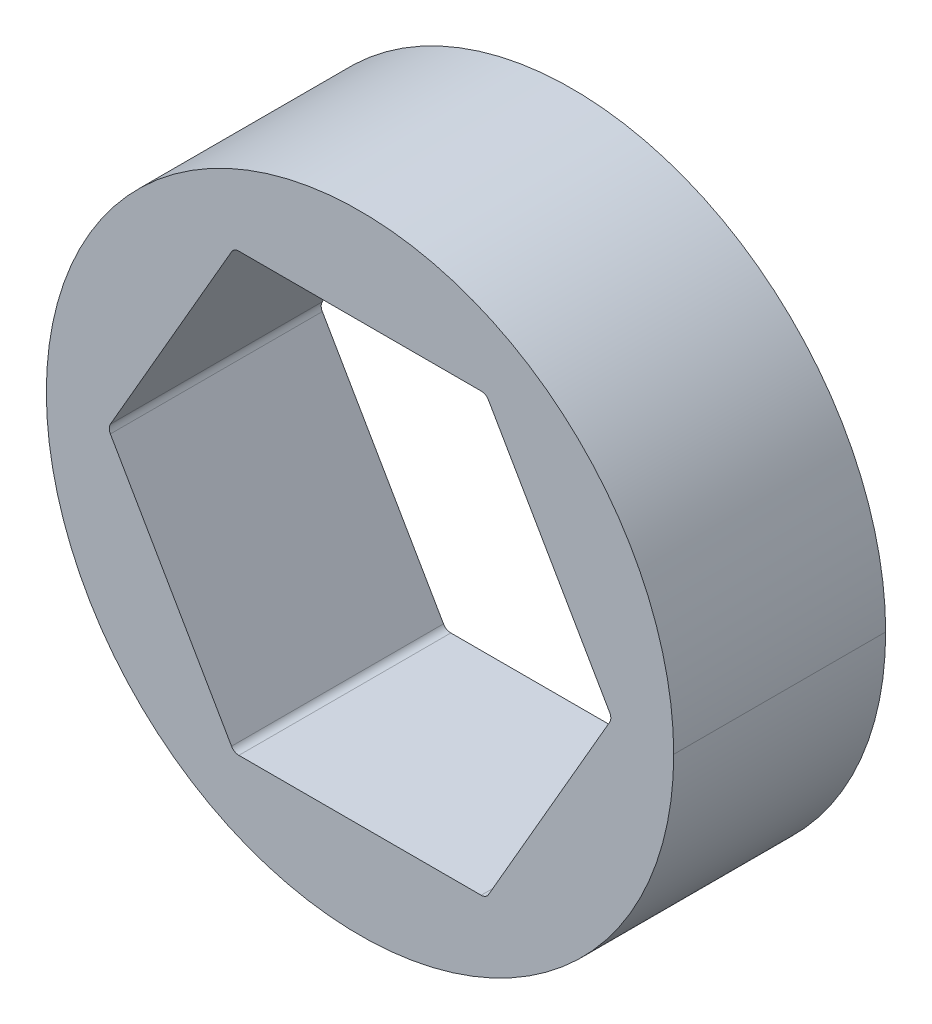
ISO-10303-21;
HEADER;
FILE_DESCRIPTION(('STEP AP214'),'2;1');
FILE_NAME('part.step','',(''),(''),'','','');
FILE_SCHEMA(('AUTOMOTIVE_DESIGN { 1 0 10303 214 1 1 1 1 }'));
ENDSEC;
DATA;
#1=APPLICATION_CONTEXT('core data for automotive mechanical design processes');
#2=APPLICATION_PROTOCOL_DEFINITION('international standard','automotive_design',2000,#1);
#3=PRODUCT_CONTEXT('',#1,'mechanical');
#4=PRODUCT('Part','Part','',(#3));
#5=PRODUCT_RELATED_PRODUCT_CATEGORY('part','',(#4));
#6=PRODUCT_DEFINITION_FORMATION('','',#4);
#7=PRODUCT_DEFINITION_CONTEXT('part definition',#1,'design');
#8=PRODUCT_DEFINITION('design','',#6,#7);
#9=PRODUCT_DEFINITION_SHAPE('','',#8);
#10=(LENGTH_UNIT() NAMED_UNIT(*) SI_UNIT(.MILLI.,.METRE.));
#11=(NAMED_UNIT(*) PLANE_ANGLE_UNIT() SI_UNIT($,.RADIAN.));
#12=(NAMED_UNIT(*) SI_UNIT($,.STERADIAN.) SOLID_ANGLE_UNIT());
#13=UNCERTAINTY_MEASURE_WITH_UNIT(LENGTH_MEASURE(1.E-05),#10,'distance_accuracy_value','');
#14=(GEOMETRIC_REPRESENTATION_CONTEXT(3) GLOBAL_UNCERTAINTY_ASSIGNED_CONTEXT((#13)) GLOBAL_UNIT_ASSIGNED_CONTEXT((#10,
#11,#12)) REPRESENTATION_CONTEXT('',''));
#15=CARTESIAN_POINT('',(0.,0.,0.));
#16=DIRECTION('',(0.,0.,1.));
#17=DIRECTION('',(1.,0.,0.));
#18=AXIS2_PLACEMENT_3D('',#15,#16,#17);
#19=CARTESIAN_POINT('',(7.25902493452117,0.,30.48));
#20=DIRECTION('',(0.,0.,1.));
#21=DIRECTION('',(1.,0.,0.));
#22=AXIS2_PLACEMENT_3D('',#19,#20,#21);
#23=CYLINDRICAL_SURFACE('',#22,0.254);
#24=CARTESIAN_POINT('',(7.25902493452117,0.,6.35));
#25=DIRECTION('',(0.,0.,1.));
#26=DIRECTION('',(1.,0.,0.));
#27=AXIS2_PLACEMENT_3D('',#24,#25,#26);
#28=CIRCLE('',#27,0.254);
#29=CARTESIAN_POINT('',(7.47899538708242,0.127,6.35));
#30=VERTEX_POINT('',#29);
#31=CARTESIAN_POINT('',(7.51302493452117,0.,6.35));
#32=VERTEX_POINT('',#31);
#33=EDGE_CURVE('E301',#30,#32,#28,.F.);
#34=ORIENTED_EDGE('',*,*,#33,.F.);
#35=DIRECTION('',(0.,0.,1.));
#36=VECTOR('',#35,1.);
#37=CARTESIAN_POINT('',(7.47899538708242,0.127,30.48));
#38=LINE('',#37,#36);
#39=CARTESIAN_POINT('',(7.47899538708242,0.127,0.));
#40=VERTEX_POINT('',#39);
#41=EDGE_CURVE('E267',#40,#30,#38,.T.);
#42=ORIENTED_EDGE('',*,*,#41,.F.);
#43=CARTESIAN_POINT('',(7.25902493452117,0.,0.));
#44=DIRECTION('',(0.,0.,1.));
#45=DIRECTION('',(1.,0.,0.));
#46=AXIS2_PLACEMENT_3D('',#43,#44,#45);
#47=CIRCLE('',#46,0.254);
#48=CARTESIAN_POINT('',(7.51302493452117,0.,0.));
#49=VERTEX_POINT('',#48);
#50=EDGE_CURVE('E199',#49,#40,#47,.T.);
#51=ORIENTED_EDGE('',*,*,#50,.F.);
#52=DIRECTION('',(0.,0.,1.));
#53=VECTOR('',#52,1.);
#54=CARTESIAN_POINT('',(7.51302493452117,0.,30.48));
#55=LINE('',#54,#53);
#56=EDGE_CURVE('E53',#49,#32,#55,.T.);
#57=ORIENTED_EDGE('',*,*,#56,.T.);
#58=EDGE_LOOP('',(#34,#42,#51,#57));
#59=FACE_BOUND('',#58,.T.);
#60=ADVANCED_FACE('F44',(#59),#23,.F.);
#61=CARTESIAN_POINT('',(0.,0.,30.48));
#62=DIRECTION('',(0.,0.,-1.));
#63=DIRECTION('',(-1.,0.,0.));
#64=AXIS2_PLACEMENT_3D('',#61,#62,#63);
#65=CYLINDRICAL_SURFACE('',#64,9.398);
#66=DIRECTION('',(0.,0.,-1.));
#67=VECTOR('',#66,1.);
#68=CARTESIAN_POINT('',(-9.398,0.,30.48));
#69=LINE('',#68,#67);
#70=CARTESIAN_POINT('',(-9.398,0.,6.35));
#71=VERTEX_POINT('',#70);
#72=CARTESIAN_POINT('',(-9.398,0.,0.));
#73=VERTEX_POINT('',#72);
#74=EDGE_CURVE('E175',#71,#73,#69,.T.);
#75=ORIENTED_EDGE('',*,*,#74,.F.);
#76=CARTESIAN_POINT('',(0.,0.,6.35));
#77=DIRECTION('',(0.,0.,1.));
#78=DIRECTION('',(1.,0.,0.));
#79=AXIS2_PLACEMENT_3D('',#76,#77,#78);
#80=CIRCLE('',#79,9.398);
#81=CARTESIAN_POINT('',(9.398,0.,6.35));
#82=VERTEX_POINT('',#81);
#83=EDGE_CURVE('E59',#82,#71,#80,.T.);
#84=ORIENTED_EDGE('',*,*,#83,.F.);
#85=DIRECTION('',(0.,0.,-1.));
#86=VECTOR('',#85,1.);
#87=CARTESIAN_POINT('',(9.398,0.,30.48));
#88=LINE('',#87,#86);
#89=CARTESIAN_POINT('',(9.398,0.,0.));
#90=VERTEX_POINT('',#89);
#91=EDGE_CURVE('E173',#82,#90,#88,.T.);
#92=ORIENTED_EDGE('',*,*,#91,.T.);
#93=CARTESIAN_POINT('',(0.,0.,0.));
#94=DIRECTION('',(0.,0.,1.));
#95=DIRECTION('',(1.,0.,0.));
#96=AXIS2_PLACEMENT_3D('',#93,#94,#95);
#97=CIRCLE('',#96,9.398);
#98=EDGE_CURVE('E182',#90,#73,#97,.T.);
#99=ORIENTED_EDGE('',*,*,#98,.T.);
#100=EDGE_LOOP('',(#75,#84,#92,#99));
#101=FACE_BOUND('',#100,.T.);
#102=ADVANCED_FACE('F171',(#101),#65,.T.);
#103=CARTESIAN_POINT('',(0.,0.,30.48));
#104=DIRECTION('',(0.,0.,-1.));
#105=DIRECTION('',(-1.,0.,0.));
#106=AXIS2_PLACEMENT_3D('',#103,#104,#105);
#107=CYLINDRICAL_SURFACE('',#106,9.398);
#108=ORIENTED_EDGE('',*,*,#91,.F.);
#109=EDGE_CURVE('E163',#71,#82,#80,.T.);
#110=ORIENTED_EDGE('',*,*,#109,.F.);
#111=ORIENTED_EDGE('',*,*,#74,.T.);
#112=CARTESIAN_POINT('',(0.,0.,0.));
#113=DIRECTION('',(0.,0.,1.));
#114=DIRECTION('',(1.,0.,0.));
#115=AXIS2_PLACEMENT_3D('',#112,#113,#114);
#116=CIRCLE('',#115,9.398);
#117=EDGE_CURVE('E180',#73,#90,#116,.T.);
#118=ORIENTED_EDGE('',*,*,#117,.T.);
#119=EDGE_LOOP('',(#108,#110,#111,#118));
#120=FACE_BOUND('',#119,.T.);
#121=ADVANCED_FACE('F178',(#120),#107,.T.);
#122=CARTESIAN_POINT('',(3.77615943563475,-6.5405,30.48));
#123=DIRECTION('',(-0.866025403784439,0.5,0.));
#124=DIRECTION('',(0.,0.,1.));
#125=AXIS2_PLACEMENT_3D('',#122,#123,#124);
#126=PLANE('',#125);
#127=DIRECTION('',(0.,0.,1.));
#128=VECTOR('',#127,1.);
#129=CARTESIAN_POINT('',(3.84948291982184,-6.4135,30.48));
#130=LINE('',#129,#128);
#131=CARTESIAN_POINT('',(3.84948291982184,-6.4135,0.));
#132=VERTEX_POINT('',#131);
#133=CARTESIAN_POINT('',(3.84948291982184,-6.4135,6.35));
#134=VERTEX_POINT('',#133);
#135=EDGE_CURVE('E218',#132,#134,#130,.T.);
#136=ORIENTED_EDGE('',*,*,#135,.T.);
#137=DIRECTION('',(0.5,0.866025403784439,0.));
#138=VECTOR('',#137,1.);
#139=CARTESIAN_POINT('',(3.77615943563475,-6.5405,6.35));
#140=LINE('',#139,#138);
#141=CARTESIAN_POINT('',(7.47899538708242,-0.127000000000001,6.35));
#142=VERTEX_POINT('',#141);
#143=EDGE_CURVE('E311',#134,#142,#140,.T.);
#144=ORIENTED_EDGE('',*,*,#143,.T.);
#145=DIRECTION('',(0.,0.,-1.));
#146=VECTOR('',#145,1.);
#147=CARTESIAN_POINT('',(7.47899538708242,-0.127,0.));
#148=LINE('',#147,#146);
#149=CARTESIAN_POINT('',(7.47899538708242,-0.127000000000001,0.));
#150=VERTEX_POINT('',#149);
#151=EDGE_CURVE('E222',#142,#150,#148,.T.);
#152=ORIENTED_EDGE('',*,*,#151,.T.);
#153=DIRECTION('',(0.5,0.866025403784439,0.));
#154=VECTOR('',#153,1.);
#155=CARTESIAN_POINT('',(3.77615943563475,-6.5405,0.));
#156=LINE('',#155,#154);
#157=EDGE_CURVE('E198',#132,#150,#156,.T.);
#158=ORIENTED_EDGE('',*,*,#157,.F.);
#159=EDGE_LOOP('',(#136,#144,#152,#158));
#160=FACE_BOUND('',#159,.T.);
#161=ADVANCED_FACE('F434',(#160),#126,.T.);
#162=CARTESIAN_POINT('',(7.5523188712695,0.,30.48));
#163=DIRECTION('',(-0.866025403784438,-0.5,0.));
#164=DIRECTION('',(-0.5,0.866025403784438,0.));
#165=AXIS2_PLACEMENT_3D('',#162,#163,#164);
#166=PLANE('',#165);
#167=ORIENTED_EDGE('',*,*,#41,.T.);
#168=DIRECTION('',(-0.5,0.866025403784438,0.));
#169=VECTOR('',#168,1.);
#170=CARTESIAN_POINT('',(7.5523188712695,0.,6.35));
#171=LINE('',#170,#169);
#172=CARTESIAN_POINT('',(3.84948291982183,6.4135,6.35));
#173=VERTEX_POINT('',#172);
#174=EDGE_CURVE('E296',#30,#173,#171,.T.);
#175=ORIENTED_EDGE('',*,*,#174,.T.);
#176=DIRECTION('',(0.,0.,-1.));
#177=VECTOR('',#176,1.);
#178=CARTESIAN_POINT('',(3.84948291982183,6.4135,0.));
#179=LINE('',#178,#177);
#180=CARTESIAN_POINT('',(3.84948291982183,6.4135,0.));
#181=VERTEX_POINT('',#180);
#182=EDGE_CURVE('E228',#173,#181,#179,.T.);
#183=ORIENTED_EDGE('',*,*,#182,.T.);
#184=DIRECTION('',(-0.5,0.866025403784438,0.));
#185=VECTOR('',#184,1.);
#186=CARTESIAN_POINT('',(7.5523188712695,0.,0.));
#187=LINE('',#186,#185);
#188=EDGE_CURVE('E226',#40,#181,#187,.T.);
#189=ORIENTED_EDGE('',*,*,#188,.F.);
#190=EDGE_LOOP('',(#167,#175,#183,#189));
#191=FACE_BOUND('',#190,.T.);
#192=ADVANCED_FACE('F295',(#191),#166,.T.);
#193=CARTESIAN_POINT('',(3.77615943563475,6.5405,30.48));
#194=DIRECTION('',(0.,-1.,0.));
#195=DIRECTION('',(0.,0.,-1.));
#196=AXIS2_PLACEMENT_3D('',#193,#194,#195);
#197=PLANE('',#196);
#198=DIRECTION('',(0.,0.,1.));
#199=VECTOR('',#198,1.);
#200=CARTESIAN_POINT('',(3.62951246726058,6.5405,30.48));
#201=LINE('',#200,#199);
#202=CARTESIAN_POINT('',(3.62951246726058,6.5405,0.));
#203=VERTEX_POINT('',#202);
#204=CARTESIAN_POINT('',(3.62951246726058,6.5405,6.35));
#205=VERTEX_POINT('',#204);
#206=EDGE_CURVE('E263',#203,#205,#201,.T.);
#207=ORIENTED_EDGE('',*,*,#206,.T.);
#208=DIRECTION('',(-1.,0.,0.));
#209=VECTOR('',#208,1.);
#210=CARTESIAN_POINT('',(3.77615943563475,6.5405,6.35));
#211=LINE('',#210,#209);
#212=CARTESIAN_POINT('',(-3.62951246726058,6.5405,6.35));
#213=VERTEX_POINT('',#212);
#214=EDGE_CURVE('E323',#205,#213,#211,.T.);
#215=ORIENTED_EDGE('',*,*,#214,.T.);
#216=DIRECTION('',(0.,0.,-1.));
#217=VECTOR('',#216,1.);
#218=CARTESIAN_POINT('',(-3.62951246726058,6.5405,0.));
#219=LINE('',#218,#217);
#220=CARTESIAN_POINT('',(-3.62951246726058,6.5405,0.));
#221=VERTEX_POINT('',#220);
#222=EDGE_CURVE('E268',#213,#221,#219,.T.);
#223=ORIENTED_EDGE('',*,*,#222,.T.);
#224=DIRECTION('',(-1.,0.,0.));
#225=VECTOR('',#224,1.);
#226=CARTESIAN_POINT('',(3.77615943563475,6.5405,0.));
#227=LINE('',#226,#225);
#228=EDGE_CURVE('E251',#203,#221,#227,.T.);
#229=ORIENTED_EDGE('',*,*,#228,.F.);
#230=EDGE_LOOP('',(#207,#215,#223,#229));
#231=FACE_BOUND('',#230,.T.);
#232=ADVANCED_FACE('F450',(#231),#197,.T.);
#233=CARTESIAN_POINT('',(-3.77615943563474,6.5405,30.48));
#234=DIRECTION('',(0.866025403784439,-0.5,0.));
#235=DIRECTION('',(0.,0.,-1.));
#236=AXIS2_PLACEMENT_3D('',#233,#234,#235);
#237=PLANE('',#236);
#238=DIRECTION('',(0.,0.,1.));
#239=VECTOR('',#238,1.);
#240=CARTESIAN_POINT('',(-3.84948291982183,6.4135,30.48));
#241=LINE('',#240,#239);
#242=CARTESIAN_POINT('',(-3.84948291982183,6.4135,0.));
#243=VERTEX_POINT('',#242);
#244=CARTESIAN_POINT('',(-3.84948291982183,6.4135,6.35));
#245=VERTEX_POINT('',#244);
#246=EDGE_CURVE('E192',#243,#245,#241,.T.);
#247=ORIENTED_EDGE('',*,*,#246,.T.);
#248=DIRECTION('',(-0.5,-0.866025403784439,0.));
#249=VECTOR('',#248,1.);
#250=CARTESIAN_POINT('',(-3.77615943563474,6.5405,6.35));
#251=LINE('',#250,#249);
#252=CARTESIAN_POINT('',(-7.47899538708242,0.127000000000006,6.35));
#253=VERTEX_POINT('',#252);
#254=EDGE_CURVE('E337',#245,#253,#251,.T.);
#255=ORIENTED_EDGE('',*,*,#254,.T.);
#256=DIRECTION('',(0.,0.,-1.));
#257=VECTOR('',#256,1.);
#258=CARTESIAN_POINT('',(-7.47899538708241,0.127000000000002,0.));
#259=LINE('',#258,#257);
#260=CARTESIAN_POINT('',(-7.47899538708241,0.127000000000003,0.));
#261=VERTEX_POINT('',#260);
#262=EDGE_CURVE('E241',#253,#261,#259,.T.);
#263=ORIENTED_EDGE('',*,*,#262,.T.);
#264=DIRECTION('',(-0.5,-0.866025403784439,0.));
#265=VECTOR('',#264,1.);
#266=CARTESIAN_POINT('',(-3.77615943563474,6.5405,0.));
#267=LINE('',#266,#265);
#268=EDGE_CURVE('E252',#243,#261,#267,.T.);
#269=ORIENTED_EDGE('',*,*,#268,.F.);
#270=EDGE_LOOP('',(#247,#255,#263,#269));
#271=FACE_BOUND('',#270,.T.);
#272=ADVANCED_FACE('F358',(#271),#237,.T.);
#273=CARTESIAN_POINT('',(-7.5523188712695,0.,30.48));
#274=DIRECTION('',(0.866025403784439,0.5,0.));
#275=DIRECTION('',(0.,0.,-1.));
#276=AXIS2_PLACEMENT_3D('',#273,#274,#275);
#277=PLANE('',#276);
#278=DIRECTION('',(0.,0.,1.));
#279=VECTOR('',#278,1.);
#280=CARTESIAN_POINT('',(-7.47899538708241,-0.126999999999998,30.48));
#281=LINE('',#280,#279);
#282=CARTESIAN_POINT('',(-7.47899538708241,-0.126999999999999,0.));
#283=VERTEX_POINT('',#282);
#284=CARTESIAN_POINT('',(-7.47899538708241,-0.126999999999998,6.35));
#285=VERTEX_POINT('',#284);
#286=EDGE_CURVE('E205',#283,#285,#281,.T.);
#287=ORIENTED_EDGE('',*,*,#286,.T.);
#288=DIRECTION('',(0.5,-0.866025403784439,0.));
#289=VECTOR('',#288,1.);
#290=CARTESIAN_POINT('',(-7.5523188712695,0.,6.35));
#291=LINE('',#290,#289);
#292=CARTESIAN_POINT('',(-3.84948291982184,-6.4135,6.35));
#293=VERTEX_POINT('',#292);
#294=EDGE_CURVE('E66',#285,#293,#291,.T.);
#295=ORIENTED_EDGE('',*,*,#294,.T.);
#296=DIRECTION('',(0.,0.,-1.));
#297=VECTOR('',#296,1.);
#298=CARTESIAN_POINT('',(-3.84948291982183,-6.4135,0.));
#299=LINE('',#298,#297);
#300=CARTESIAN_POINT('',(-3.84948291982183,-6.4135,0.));
#301=VERTEX_POINT('',#300);
#302=EDGE_CURVE('E209',#293,#301,#299,.T.);
#303=ORIENTED_EDGE('',*,*,#302,.T.);
#304=DIRECTION('',(0.5,-0.866025403784439,0.));
#305=VECTOR('',#304,1.);
#306=CARTESIAN_POINT('',(-7.5523188712695,0.,0.));
#307=LINE('',#306,#305);
#308=EDGE_CURVE('E217',#283,#301,#307,.T.);
#309=ORIENTED_EDGE('',*,*,#308,.F.);
#310=EDGE_LOOP('',(#287,#295,#303,#309));
#311=FACE_BOUND('',#310,.T.);
#312=ADVANCED_FACE('F344',(#311),#277,.T.);
#313=CARTESIAN_POINT('',(-3.77615943563474,-6.5405,30.48));
#314=DIRECTION('',(0.,1.,0.));
#315=DIRECTION('',(1.,0.,0.));
#316=AXIS2_PLACEMENT_3D('',#313,#314,#315);
#317=PLANE('',#316);
#318=DIRECTION('',(0.,0.,1.));
#319=VECTOR('',#318,1.);
#320=CARTESIAN_POINT('',(-3.62951246726058,-6.5405,30.48));
#321=LINE('',#320,#319);
#322=CARTESIAN_POINT('',(-3.62951246726058,-6.5405,0.));
#323=VERTEX_POINT('',#322);
#324=CARTESIAN_POINT('',(-3.62951246726058,-6.5405,6.35));
#325=VERTEX_POINT('',#324);
#326=EDGE_CURVE('E203',#323,#325,#321,.T.);
#327=ORIENTED_EDGE('',*,*,#326,.T.);
#328=DIRECTION('',(1.,0.,0.));
#329=VECTOR('',#328,1.);
#330=CARTESIAN_POINT('',(-3.77615943563474,-6.5405,6.35));
#331=LINE('',#330,#329);
#332=CARTESIAN_POINT('',(3.62951246726059,-6.5405,6.35));
#333=VERTEX_POINT('',#332);
#334=EDGE_CURVE('E327',#325,#333,#331,.T.);
#335=ORIENTED_EDGE('',*,*,#334,.T.);
#336=DIRECTION('',(0.,0.,-1.));
#337=VECTOR('',#336,1.);
#338=CARTESIAN_POINT('',(3.62951246726059,-6.5405,0.));
#339=LINE('',#338,#337);
#340=CARTESIAN_POINT('',(3.62951246726058,-6.5405,0.));
#341=VERTEX_POINT('',#340);
#342=EDGE_CURVE('E200',#333,#341,#339,.T.);
#343=ORIENTED_EDGE('',*,*,#342,.T.);
#344=DIRECTION('',(1.,0.,0.));
#345=VECTOR('',#344,1.);
#346=CARTESIAN_POINT('',(-3.77615943563474,-6.5405,0.));
#347=LINE('',#346,#345);
#348=EDGE_CURVE('E188',#323,#341,#347,.T.);
#349=ORIENTED_EDGE('',*,*,#348,.F.);
#350=EDGE_LOOP('',(#327,#335,#343,#349));
#351=FACE_BOUND('',#350,.T.);
#352=ADVANCED_FACE('F473',(#351),#317,.T.);
#353=CARTESIAN_POINT('',(3.62951246726058,6.2865,30.48));
#354=DIRECTION('',(0.,0.,1.));
#355=DIRECTION('',(1.,0.,0.));
#356=AXIS2_PLACEMENT_3D('',#353,#354,#355);
#357=CYLINDRICAL_SURFACE('',#356,0.254);
#358=CARTESIAN_POINT('',(3.62951246726058,6.2865,6.35));
#359=DIRECTION('',(0.,0.,1.));
#360=DIRECTION('',(1.,0.,0.));
#361=AXIS2_PLACEMENT_3D('',#358,#359,#360);
#362=CIRCLE('',#361,0.254);
#363=EDGE_CURVE('E317',#205,#173,#362,.F.);
#364=ORIENTED_EDGE('',*,*,#363,.F.);
#365=ORIENTED_EDGE('',*,*,#206,.F.);
#366=CARTESIAN_POINT('',(3.62951246726058,6.2865,0.));
#367=DIRECTION('',(0.,0.,1.));
#368=DIRECTION('',(1.,0.,0.));
#369=AXIS2_PLACEMENT_3D('',#366,#367,#368);
#370=CIRCLE('',#369,0.254);
#371=EDGE_CURVE('E256',#181,#203,#370,.T.);
#372=ORIENTED_EDGE('',*,*,#371,.F.);
#373=ORIENTED_EDGE('',*,*,#182,.F.);
#374=EDGE_LOOP('',(#364,#365,#372,#373));
#375=FACE_BOUND('',#374,.T.);
#376=ADVANCED_FACE('F481',(#375),#357,.F.);
#377=CARTESIAN_POINT('',(-3.62951246726058,6.2865,30.48));
#378=DIRECTION('',(0.,0.,1.));
#379=DIRECTION('',(1.,0.,0.));
#380=AXIS2_PLACEMENT_3D('',#377,#378,#379);
#381=CYLINDRICAL_SURFACE('',#380,0.254);
#382=CARTESIAN_POINT('',(-3.62951246726058,6.2865,6.35));
#383=DIRECTION('',(0.,0.,1.));
#384=DIRECTION('',(1.,0.,0.));
#385=AXIS2_PLACEMENT_3D('',#382,#383,#384);
#386=CIRCLE('',#385,0.254);
#387=EDGE_CURVE('E331',#245,#213,#386,.F.);
#388=ORIENTED_EDGE('',*,*,#387,.F.);
#389=ORIENTED_EDGE('',*,*,#246,.F.);
#390=CARTESIAN_POINT('',(-3.62951246726058,6.2865,0.));
#391=DIRECTION('',(0.,0.,1.));
#392=DIRECTION('',(1.,0.,0.));
#393=AXIS2_PLACEMENT_3D('',#390,#391,#392);
#394=CIRCLE('',#393,0.254);
#395=EDGE_CURVE('E247',#221,#243,#394,.T.);
#396=ORIENTED_EDGE('',*,*,#395,.F.);
#397=ORIENTED_EDGE('',*,*,#222,.F.);
#398=EDGE_LOOP('',(#388,#389,#396,#397));
#399=FACE_BOUND('',#398,.T.);
#400=ADVANCED_FACE('F490',(#399),#381,.F.);
#401=CARTESIAN_POINT('',(-3.62951246726058,-6.2865,30.48));
#402=DIRECTION('',(0.,0.,1.));
#403=DIRECTION('',(1.,0.,0.));
#404=AXIS2_PLACEMENT_3D('',#401,#402,#403);
#405=CYLINDRICAL_SURFACE('',#404,0.254);
#406=CARTESIAN_POINT('',(-3.62951246726058,-6.2865,6.35));
#407=DIRECTION('',(0.,0.,1.));
#408=DIRECTION('',(1.,0.,0.));
#409=AXIS2_PLACEMENT_3D('',#406,#407,#408);
#410=CIRCLE('',#409,0.254);
#411=EDGE_CURVE('E334',#325,#293,#410,.F.);
#412=ORIENTED_EDGE('',*,*,#411,.F.);
#413=ORIENTED_EDGE('',*,*,#326,.F.);
#414=CARTESIAN_POINT('',(-3.62951246726058,-6.2865,0.));
#415=DIRECTION('',(0.,0.,1.));
#416=DIRECTION('',(1.,0.,0.));
#417=AXIS2_PLACEMENT_3D('',#414,#415,#416);
#418=CIRCLE('',#417,0.254);
#419=EDGE_CURVE('E214',#301,#323,#418,.T.);
#420=ORIENTED_EDGE('',*,*,#419,.F.);
#421=ORIENTED_EDGE('',*,*,#302,.F.);
#422=EDGE_LOOP('',(#412,#413,#420,#421));
#423=FACE_BOUND('',#422,.T.);
#424=ADVANCED_FACE('F349',(#423),#405,.F.);
#425=CARTESIAN_POINT('',(3.62951246726059,-6.2865,30.48));
#426=DIRECTION('',(0.,0.,1.));
#427=DIRECTION('',(1.,0.,0.));
#428=AXIS2_PLACEMENT_3D('',#425,#426,#427);
#429=CYLINDRICAL_SURFACE('',#428,0.254);
#430=CARTESIAN_POINT('',(3.62951246726059,-6.2865,6.35));
#431=DIRECTION('',(0.,0.,1.));
#432=DIRECTION('',(1.,0.,0.));
#433=AXIS2_PLACEMENT_3D('',#430,#431,#432);
#434=CIRCLE('',#433,0.254);
#435=EDGE_CURVE('E320',#134,#333,#434,.F.);
#436=ORIENTED_EDGE('',*,*,#435,.F.);
#437=ORIENTED_EDGE('',*,*,#135,.F.);
#438=CARTESIAN_POINT('',(3.62951246726059,-6.2865,0.));
#439=DIRECTION('',(0.,0.,1.));
#440=DIRECTION('',(1.,0.,0.));
#441=AXIS2_PLACEMENT_3D('',#438,#439,#440);
#442=CIRCLE('',#441,0.254);
#443=EDGE_CURVE('E210',#341,#132,#442,.T.);
#444=ORIENTED_EDGE('',*,*,#443,.F.);
#445=ORIENTED_EDGE('',*,*,#342,.F.);
#446=EDGE_LOOP('',(#436,#437,#444,#445));
#447=FACE_BOUND('',#446,.T.);
#448=ADVANCED_FACE('F506',(#447),#429,.F.);
#449=CARTESIAN_POINT('',(7.25902493452117,0.,30.48));
#450=DIRECTION('',(0.,0.,1.));
#451=DIRECTION('',(1.,0.,0.));
#452=AXIS2_PLACEMENT_3D('',#449,#450,#451);
#453=CYLINDRICAL_SURFACE('',#452,0.254);
#454=CARTESIAN_POINT('',(7.25902493452117,0.,6.35));
#455=DIRECTION('',(0.,0.,1.));
#456=DIRECTION('',(1.,0.,0.));
#457=AXIS2_PLACEMENT_3D('',#454,#455,#456);
#458=CIRCLE('',#457,0.254);
#459=EDGE_CURVE('E204',#32,#142,#458,.F.);
#460=ORIENTED_EDGE('',*,*,#459,.F.);
#461=ORIENTED_EDGE('',*,*,#56,.F.);
#462=CARTESIAN_POINT('',(7.25902493452117,0.,0.));
#463=DIRECTION('',(0.,0.,1.));
#464=DIRECTION('',(1.,0.,0.));
#465=AXIS2_PLACEMENT_3D('',#462,#463,#464);
#466=CIRCLE('',#465,0.254);
#467=EDGE_CURVE('E194',#150,#49,#466,.T.);
#468=ORIENTED_EDGE('',*,*,#467,.F.);
#469=ORIENTED_EDGE('',*,*,#151,.F.);
#470=EDGE_LOOP('',(#460,#461,#468,#469));
#471=FACE_BOUND('',#470,.T.);
#472=ADVANCED_FACE('F307',(#471),#453,.F.);
#473=CARTESIAN_POINT('',(-7.25902493452117,0.,30.48));
#474=DIRECTION('',(0.,0.,1.));
#475=DIRECTION('',(1.,0.,0.));
#476=AXIS2_PLACEMENT_3D('',#473,#474,#475);
#477=CYLINDRICAL_SURFACE('',#476,0.254);
#478=CARTESIAN_POINT('',(-7.25902493452117,0.,6.35));
#479=DIRECTION('',(0.,0.,1.));
#480=DIRECTION('',(1.,0.,0.));
#481=AXIS2_PLACEMENT_3D('',#478,#479,#480);
#482=CIRCLE('',#481,0.254);
#483=EDGE_CURVE('E11',#285,#253,#482,.F.);
#484=ORIENTED_EDGE('',*,*,#483,.F.);
#485=ORIENTED_EDGE('',*,*,#286,.F.);
#486=CARTESIAN_POINT('',(-7.25902493452117,0.,0.));
#487=DIRECTION('',(0.,0.,1.));
#488=DIRECTION('',(1.,0.,0.));
#489=AXIS2_PLACEMENT_3D('',#486,#487,#488);
#490=CIRCLE('',#489,0.254);
#491=EDGE_CURVE('E238',#261,#283,#490,.T.);
#492=ORIENTED_EDGE('',*,*,#491,.F.);
#493=ORIENTED_EDGE('',*,*,#262,.F.);
#494=EDGE_LOOP('',(#484,#485,#492,#493));
#495=FACE_BOUND('',#494,.T.);
#496=ADVANCED_FACE('F46',(#495),#477,.F.);
#497=CARTESIAN_POINT('',(0.,0.,0.));
#498=DIRECTION('',(0.,0.,1.));
#499=DIRECTION('',(1.,0.,0.));
#500=AXIS2_PLACEMENT_3D('',#497,#498,#499);
#501=PLANE('',#500);
#502=ORIENTED_EDGE('',*,*,#117,.F.);
#503=ORIENTED_EDGE('',*,*,#98,.F.);
#504=EDGE_LOOP('',(#502,#503));
#505=FACE_BOUND('',#504,.T.);
#506=ORIENTED_EDGE('',*,*,#348,.T.);
#507=ORIENTED_EDGE('',*,*,#443,.T.);
#508=ORIENTED_EDGE('',*,*,#157,.T.);
#509=ORIENTED_EDGE('',*,*,#467,.T.);
#510=ORIENTED_EDGE('',*,*,#50,.T.);
#511=ORIENTED_EDGE('',*,*,#188,.T.);
#512=ORIENTED_EDGE('',*,*,#371,.T.);
#513=ORIENTED_EDGE('',*,*,#228,.T.);
#514=ORIENTED_EDGE('',*,*,#395,.T.);
#515=ORIENTED_EDGE('',*,*,#268,.T.);
#516=ORIENTED_EDGE('',*,*,#491,.T.);
#517=ORIENTED_EDGE('',*,*,#308,.T.);
#518=ORIENTED_EDGE('',*,*,#419,.T.);
#519=EDGE_LOOP('',(#506,#507,#508,#509,#510,#511,#512,#513,#514,#515,#516,#517,#518));
#520=FACE_BOUND('',#519,.T.);
#521=ADVANCED_FACE('F302',(#505,#520),#501,.F.);
#522=CARTESIAN_POINT('',(0.,0.,6.35));
#523=DIRECTION('',(0.,0.,1.));
#524=DIRECTION('',(1.,0.,0.));
#525=AXIS2_PLACEMENT_3D('',#522,#523,#524);
#526=PLANE('',#525);
#527=ORIENTED_EDGE('',*,*,#83,.T.);
#528=ORIENTED_EDGE('',*,*,#109,.T.);
#529=EDGE_LOOP('',(#527,#528));
#530=FACE_BOUND('',#529,.T.);
#531=ORIENTED_EDGE('',*,*,#459,.T.);
#532=ORIENTED_EDGE('',*,*,#143,.F.);
#533=ORIENTED_EDGE('',*,*,#435,.T.);
#534=ORIENTED_EDGE('',*,*,#334,.F.);
#535=ORIENTED_EDGE('',*,*,#411,.T.);
#536=ORIENTED_EDGE('',*,*,#294,.F.);
#537=ORIENTED_EDGE('',*,*,#483,.T.);
#538=ORIENTED_EDGE('',*,*,#254,.F.);
#539=ORIENTED_EDGE('',*,*,#387,.T.);
#540=ORIENTED_EDGE('',*,*,#214,.F.);
#541=ORIENTED_EDGE('',*,*,#363,.T.);
#542=ORIENTED_EDGE('',*,*,#174,.F.);
#543=ORIENTED_EDGE('',*,*,#33,.T.);
#544=EDGE_LOOP('',(#531,#532,#533,#534,#535,#536,#537,#538,#539,#540,#541,#542,#543));
#545=FACE_BOUND('',#544,.T.);
#546=ADVANCED_FACE('F164',(#530,#545),#526,.T.);
#547=CLOSED_SHELL('',(#60,#102,#121,#161,#192,#232,#272,#312,#352,#376,#400,#424,#448,#472,#496,
#521,#546));
#548=MANIFOLD_SOLID_BREP('B2',#547);
#549=ADVANCED_BREP_SHAPE_REPRESENTATION('',(#18,#548),#14);
#550=SHAPE_DEFINITION_REPRESENTATION(#9,#549);
ENDSEC;
END-ISO-10303-21;
